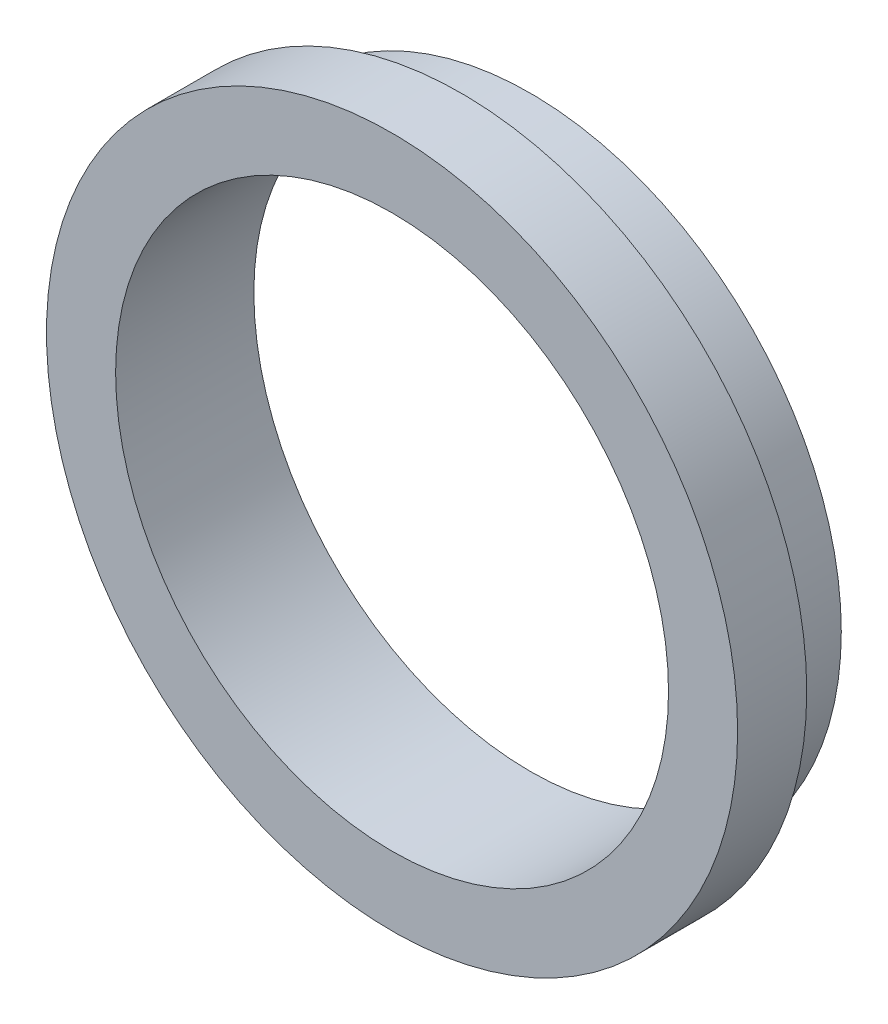
ISO-10303-21;
HEADER;
FILE_DESCRIPTION(('STEP AP214'),'2;1');
FILE_NAME('part.step','',(''),(''),'','','');
FILE_SCHEMA(('AUTOMOTIVE_DESIGN { 1 0 10303 214 1 1 1 1 }'));
ENDSEC;
DATA;
#1=APPLICATION_CONTEXT('core data for automotive mechanical design processes');
#2=APPLICATION_PROTOCOL_DEFINITION('international standard','automotive_design',2000,#1);
#3=PRODUCT_CONTEXT('',#1,'mechanical');
#4=PRODUCT('Part','Part','',(#3));
#5=PRODUCT_RELATED_PRODUCT_CATEGORY('part','',(#4));
#6=PRODUCT_DEFINITION_FORMATION('','',#4);
#7=PRODUCT_DEFINITION_CONTEXT('part definition',#1,'design');
#8=PRODUCT_DEFINITION('design','',#6,#7);
#9=PRODUCT_DEFINITION_SHAPE('','',#8);
#10=(LENGTH_UNIT() NAMED_UNIT(*) SI_UNIT(.MILLI.,.METRE.));
#11=(NAMED_UNIT(*) PLANE_ANGLE_UNIT() SI_UNIT($,.RADIAN.));
#12=(NAMED_UNIT(*) SI_UNIT($,.STERADIAN.) SOLID_ANGLE_UNIT());
#13=UNCERTAINTY_MEASURE_WITH_UNIT(LENGTH_MEASURE(1.E-05),#10,'distance_accuracy_value','');
#14=(GEOMETRIC_REPRESENTATION_CONTEXT(3) GLOBAL_UNCERTAINTY_ASSIGNED_CONTEXT((#13)) GLOBAL_UNIT_ASSIGNED_CONTEXT((#10,
#11,#12)) REPRESENTATION_CONTEXT('',''));
#15=CARTESIAN_POINT('',(0.,0.,0.));
#16=DIRECTION('',(0.,0.,1.));
#17=DIRECTION('',(1.,0.,0.));
#18=AXIS2_PLACEMENT_3D('',#15,#16,#17);
#19=CARTESIAN_POINT('',(0.,0.,1.));
#20=DIRECTION('',(0.,0.,-1.));
#21=DIRECTION('',(-1.,0.,0.));
#22=AXIS2_PLACEMENT_3D('',#19,#20,#21);
#23=CYLINDRICAL_SURFACE('',#22,4.5);
#24=CARTESIAN_POINT('',(0.,0.,1.));
#25=DIRECTION('',(0.,0.,1.));
#26=DIRECTION('',(1.,0.,0.));
#27=AXIS2_PLACEMENT_3D('',#24,#25,#26);
#28=CIRCLE('',#27,4.5);
#29=CARTESIAN_POINT('',(4.5,0.,1.));
#30=VERTEX_POINT('',#29);
#31=EDGE_CURVE('E10',#30,#30,#28,.T.);
#32=ORIENTED_EDGE('',*,*,#31,.F.);
#33=EDGE_LOOP('',(#32));
#34=FACE_BOUND('',#33,.T.);
#35=CARTESIAN_POINT('',(0.,0.,0.));
#36=DIRECTION('',(0.,0.,1.));
#37=DIRECTION('',(1.,0.,0.));
#38=AXIS2_PLACEMENT_3D('',#35,#36,#37);
#39=CIRCLE('',#38,4.5);
#40=CARTESIAN_POINT('',(4.5,0.,0.));
#41=VERTEX_POINT('',#40);
#42=EDGE_CURVE('E40',#41,#41,#39,.T.);
#43=ORIENTED_EDGE('',*,*,#42,.T.);
#44=EDGE_LOOP('',(#43));
#45=FACE_BOUND('',#44,.T.);
#46=ADVANCED_FACE('F37',(#34,#45),#23,.T.);
#47=CARTESIAN_POINT('',(0.,0.,0.));
#48=DIRECTION('',(0.,0.,1.));
#49=DIRECTION('',(1.,0.,0.));
#50=AXIS2_PLACEMENT_3D('',#47,#48,#49);
#51=PLANE('',#50);
#52=CARTESIAN_POINT('',(0.,0.,0.));
#53=DIRECTION('',(0.,0.,-1.));
#54=DIRECTION('',(-1.,0.,0.));
#55=AXIS2_PLACEMENT_3D('',#52,#53,#54);
#56=CIRCLE('',#55,4.);
#57=CARTESIAN_POINT('',(-4.,0.,0.));
#58=VERTEX_POINT('',#57);
#59=EDGE_CURVE('E59',#58,#58,#56,.T.);
#60=ORIENTED_EDGE('',*,*,#59,.F.);
#61=EDGE_LOOP('',(#60));
#62=FACE_BOUND('',#61,.T.);
#63=ORIENTED_EDGE('',*,*,#42,.F.);
#64=EDGE_LOOP('',(#63));
#65=FACE_BOUND('',#64,.T.);
#66=ADVANCED_FACE('F77',(#62,#65),#51,.F.);
#67=CARTESIAN_POINT('',(0.,0.,2.));
#68=DIRECTION('',(0.,0.,-1.));
#69=DIRECTION('',(-1.,0.,0.));
#70=AXIS2_PLACEMENT_3D('',#67,#68,#69);
#71=CYLINDRICAL_SURFACE('',#70,5.);
#72=CARTESIAN_POINT('',(0.,0.,2.));
#73=DIRECTION('',(0.,0.,1.));
#74=DIRECTION('',(1.,0.,0.));
#75=AXIS2_PLACEMENT_3D('',#72,#73,#74);
#76=CIRCLE('',#75,5.);
#77=CARTESIAN_POINT('',(5.,0.,2.));
#78=VERTEX_POINT('',#77);
#79=EDGE_CURVE('E49',#78,#78,#76,.T.);
#80=ORIENTED_EDGE('',*,*,#79,.F.);
#81=EDGE_LOOP('',(#80));
#82=FACE_BOUND('',#81,.T.);
#83=CARTESIAN_POINT('',(0.,0.,1.));
#84=DIRECTION('',(0.,0.,1.));
#85=DIRECTION('',(1.,0.,0.));
#86=AXIS2_PLACEMENT_3D('',#83,#84,#85);
#87=CIRCLE('',#86,5.);
#88=CARTESIAN_POINT('',(5.,0.,1.));
#89=VERTEX_POINT('',#88);
#90=EDGE_CURVE('E51',#89,#89,#87,.T.);
#91=ORIENTED_EDGE('',*,*,#90,.T.);
#92=EDGE_LOOP('',(#91));
#93=FACE_BOUND('',#92,.T.);
#94=ADVANCED_FACE('F80',(#82,#93),#71,.T.);
#95=CARTESIAN_POINT('',(0.,0.,2.));
#96=DIRECTION('',(0.,0.,1.));
#97=DIRECTION('',(1.,0.,0.));
#98=AXIS2_PLACEMENT_3D('',#95,#96,#97);
#99=PLANE('',#98);
#100=CARTESIAN_POINT('',(0.,0.,2.));
#101=DIRECTION('',(0.,0.,-1.));
#102=DIRECTION('',(-1.,0.,0.));
#103=AXIS2_PLACEMENT_3D('',#100,#101,#102);
#104=CIRCLE('',#103,4.);
#105=CARTESIAN_POINT('',(-4.,0.,2.));
#106=VERTEX_POINT('',#105);
#107=EDGE_CURVE('E55',#106,#106,#104,.T.);
#108=ORIENTED_EDGE('',*,*,#107,.T.);
#109=EDGE_LOOP('',(#108));
#110=FACE_BOUND('',#109,.T.);
#111=ORIENTED_EDGE('',*,*,#79,.T.);
#112=EDGE_LOOP('',(#111));
#113=FACE_BOUND('',#112,.T.);
#114=ADVANCED_FACE('F67',(#110,#113),#99,.T.);
#115=CARTESIAN_POINT('',(0.,0.,1.));
#116=DIRECTION('',(0.,0.,1.));
#117=DIRECTION('',(1.,0.,0.));
#118=AXIS2_PLACEMENT_3D('',#115,#116,#117);
#119=PLANE('',#118);
#120=ORIENTED_EDGE('',*,*,#31,.T.);
#121=EDGE_LOOP('',(#120));
#122=FACE_BOUND('',#121,.T.);
#123=ORIENTED_EDGE('',*,*,#90,.F.);
#124=EDGE_LOOP('',(#123));
#125=FACE_BOUND('',#124,.T.);
#126=ADVANCED_FACE('F73',(#122,#125),#119,.F.);
#127=CARTESIAN_POINT('',(0.,0.,2.));
#128=DIRECTION('',(0.,0.,-1.));
#129=DIRECTION('',(-1.,0.,0.));
#130=AXIS2_PLACEMENT_3D('',#127,#128,#129);
#131=CYLINDRICAL_SURFACE('',#130,4.);
#132=ORIENTED_EDGE('',*,*,#107,.F.);
#133=EDGE_LOOP('',(#132));
#134=FACE_BOUND('',#133,.T.);
#135=ORIENTED_EDGE('',*,*,#59,.T.);
#136=EDGE_LOOP('',(#135));
#137=FACE_BOUND('',#136,.T.);
#138=ADVANCED_FACE('F70',(#134,#137),#131,.F.);
#139=CLOSED_SHELL('',(#46,#66,#94,#114,#126,#138));
#140=MANIFOLD_SOLID_BREP('B2',#139);
#141=ADVANCED_BREP_SHAPE_REPRESENTATION('',(#18,#140),#14);
#142=SHAPE_DEFINITION_REPRESENTATION(#9,#141);
ENDSEC;
END-ISO-10303-21;
